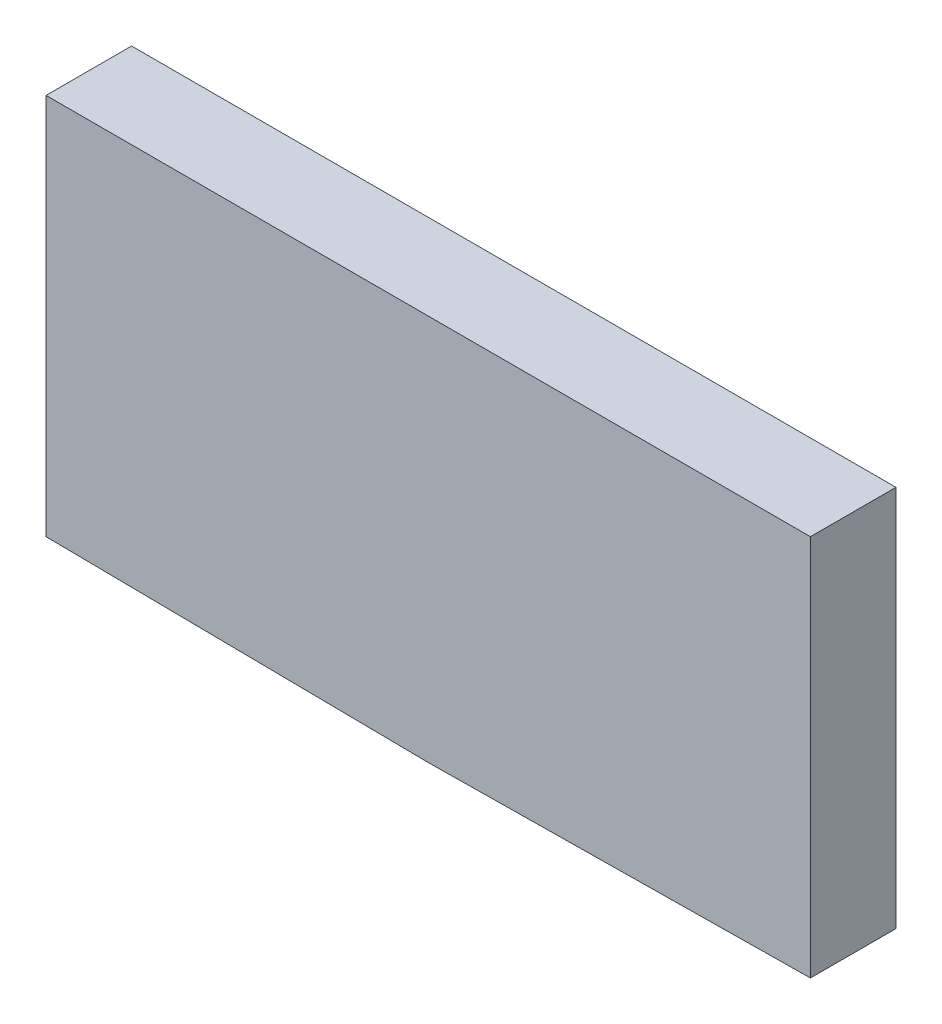
ISO-10303-21;
HEADER;
FILE_DESCRIPTION(('STEP AP214'),'2;1');
FILE_NAME('part.step','',(''),(''),'','','');
FILE_SCHEMA(('AUTOMOTIVE_DESIGN { 1 0 10303 214 1 1 1 1 }'));
ENDSEC;
DATA;
#1=APPLICATION_CONTEXT('core data for automotive mechanical design processes');
#2=APPLICATION_PROTOCOL_DEFINITION('international standard','automotive_design',2000,#1);
#3=PRODUCT_CONTEXT('',#1,'mechanical');
#4=PRODUCT('Part','Part','',(#3));
#5=PRODUCT_RELATED_PRODUCT_CATEGORY('part','',(#4));
#6=PRODUCT_DEFINITION_FORMATION('','',#4);
#7=PRODUCT_DEFINITION_CONTEXT('part definition',#1,'design');
#8=PRODUCT_DEFINITION('design','',#6,#7);
#9=PRODUCT_DEFINITION_SHAPE('','',#8);
#10=(LENGTH_UNIT() NAMED_UNIT(*) SI_UNIT(.MILLI.,.METRE.));
#11=(NAMED_UNIT(*) PLANE_ANGLE_UNIT() SI_UNIT($,.RADIAN.));
#12=(NAMED_UNIT(*) SI_UNIT($,.STERADIAN.) SOLID_ANGLE_UNIT());
#13=UNCERTAINTY_MEASURE_WITH_UNIT(LENGTH_MEASURE(1.E-05),#10,'distance_accuracy_value','');
#14=(GEOMETRIC_REPRESENTATION_CONTEXT(3) GLOBAL_UNCERTAINTY_ASSIGNED_CONTEXT((#13)) GLOBAL_UNIT_ASSIGNED_CONTEXT((#10,
#11,#12)) REPRESENTATION_CONTEXT('',''));
#15=CARTESIAN_POINT('',(0.,0.,0.));
#16=DIRECTION('',(0.,0.,1.));
#17=DIRECTION('',(1.,0.,0.));
#18=AXIS2_PLACEMENT_3D('',#15,#16,#17);
#19=CARTESIAN_POINT('',(14.3,0.168160442431913,3.2));
#20=DIRECTION('',(-0.0117586585027959,0.999930864585254,0.));
#21=DIRECTION('',(-0.999930864585255,-0.0117586585027959,0.));
#22=AXIS2_PLACEMENT_3D('',#19,#20,#21);
#23=PLANE('',#22);
#24=DIRECTION('',(0.999930864585254,0.0117586585027959,0.));
#25=VECTOR('',#24,1.);
#26=CARTESIAN_POINT('',(14.3,0.168160442431913,0.));
#27=LINE('',#26,#25);
#28=CARTESIAN_POINT('',(0.,0.,0.));
#29=VERTEX_POINT('',#28);
#30=CARTESIAN_POINT('',(14.3,0.168160442431913,0.));
#31=VERTEX_POINT('',#30);
#32=EDGE_CURVE('E111',#29,#31,#27,.T.);
#33=ORIENTED_EDGE('',*,*,#32,.T.);
#34=DIRECTION('',(0.,0.,-1.));
#35=VECTOR('',#34,1.);
#36=CARTESIAN_POINT('',(14.3,0.168160442431913,3.2));
#37=LINE('',#36,#35);
#38=CARTESIAN_POINT('',(14.3,0.168160442431913,3.2));
#39=VERTEX_POINT('',#38);
#40=EDGE_CURVE('E11',#39,#31,#37,.T.);
#41=ORIENTED_EDGE('',*,*,#40,.F.);
#42=DIRECTION('',(0.999930864585254,0.0117586585027959,0.));
#43=VECTOR('',#42,1.);
#44=CARTESIAN_POINT('',(14.3,0.168160442431913,3.2));
#45=LINE('',#44,#43);
#46=CARTESIAN_POINT('',(0.,0.,3.2));
#47=VERTEX_POINT('',#46);
#48=EDGE_CURVE('E119',#47,#39,#45,.T.);
#49=ORIENTED_EDGE('',*,*,#48,.F.);
#50=DIRECTION('',(0.,0.,-1.));
#51=VECTOR('',#50,1.);
#52=CARTESIAN_POINT('',(0.,0.,3.2));
#53=LINE('',#52,#51);
#54=EDGE_CURVE('E107',#47,#29,#53,.T.);
#55=ORIENTED_EDGE('',*,*,#54,.T.);
#56=EDGE_LOOP('',(#33,#41,#49,#55));
#57=FACE_BOUND('',#56,.T.);
#58=ADVANCED_FACE('F37',(#57),#23,.F.);
#59=CARTESIAN_POINT('',(14.3,14.4681604424319,3.2));
#60=DIRECTION('',(-1.,0.,0.));
#61=DIRECTION('',(0.,-1.,0.));
#62=AXIS2_PLACEMENT_3D('',#59,#60,#61);
#63=PLANE('',#62);
#64=DIRECTION('',(0.,1.,0.));
#65=VECTOR('',#64,1.);
#66=CARTESIAN_POINT('',(14.3,14.4681604424319,0.));
#67=LINE('',#66,#65);
#68=CARTESIAN_POINT('',(14.3,14.4681604424319,0.));
#69=VERTEX_POINT('',#68);
#70=EDGE_CURVE('E114',#31,#69,#67,.T.);
#71=ORIENTED_EDGE('',*,*,#70,.T.);
#72=DIRECTION('',(0.,0.,-1.));
#73=VECTOR('',#72,1.);
#74=CARTESIAN_POINT('',(14.3,14.4681604424319,3.2));
#75=LINE('',#74,#73);
#76=CARTESIAN_POINT('',(14.3,14.4681604424319,3.2));
#77=VERTEX_POINT('',#76);
#78=EDGE_CURVE('E45',#77,#69,#75,.T.);
#79=ORIENTED_EDGE('',*,*,#78,.F.);
#80=DIRECTION('',(0.,1.,0.));
#81=VECTOR('',#80,1.);
#82=CARTESIAN_POINT('',(14.3,14.4681604424319,3.2));
#83=LINE('',#82,#81);
#84=EDGE_CURVE('E87',#39,#77,#83,.T.);
#85=ORIENTED_EDGE('',*,*,#84,.F.);
#86=ORIENTED_EDGE('',*,*,#40,.T.);
#87=EDGE_LOOP('',(#71,#79,#85,#86));
#88=FACE_BOUND('',#87,.T.);
#89=ADVANCED_FACE('F138',(#88),#63,.F.);
#90=CARTESIAN_POINT('',(14.3,14.4681604424319,3.2));
#91=DIRECTION('',(0.,-1.,0.));
#92=DIRECTION('',(1.,0.,0.));
#93=AXIS2_PLACEMENT_3D('',#90,#91,#92);
#94=PLANE('',#93);
#95=DIRECTION('',(-1.,0.,0.));
#96=VECTOR('',#95,1.);
#97=CARTESIAN_POINT('',(14.3,14.4681604424319,0.));
#98=LINE('',#97,#96);
#99=CARTESIAN_POINT('',(-14.3,14.4681604424319,0.));
#100=VERTEX_POINT('',#99);
#101=EDGE_CURVE('E102',#69,#100,#98,.T.);
#102=ORIENTED_EDGE('',*,*,#101,.T.);
#103=DIRECTION('',(0.,0.,-1.));
#104=VECTOR('',#103,1.);
#105=CARTESIAN_POINT('',(-14.3,14.4681604424319,3.2));
#106=LINE('',#105,#104);
#107=CARTESIAN_POINT('',(-14.3,14.4681604424319,3.2));
#108=VERTEX_POINT('',#107);
#109=EDGE_CURVE('E99',#108,#100,#106,.T.);
#110=ORIENTED_EDGE('',*,*,#109,.F.);
#111=DIRECTION('',(-1.,0.,0.));
#112=VECTOR('',#111,1.);
#113=CARTESIAN_POINT('',(14.3,14.4681604424319,3.2));
#114=LINE('',#113,#112);
#115=EDGE_CURVE('E91',#77,#108,#114,.T.);
#116=ORIENTED_EDGE('',*,*,#115,.F.);
#117=ORIENTED_EDGE('',*,*,#78,.T.);
#118=EDGE_LOOP('',(#102,#110,#116,#117));
#119=FACE_BOUND('',#118,.T.);
#120=ADVANCED_FACE('F100',(#119),#94,.F.);
#121=CARTESIAN_POINT('',(-14.3,14.4681604424319,3.2));
#122=DIRECTION('',(1.,0.,0.));
#123=DIRECTION('',(0.,1.,0.));
#124=AXIS2_PLACEMENT_3D('',#121,#122,#123);
#125=PLANE('',#124);
#126=DIRECTION('',(0.,-1.,0.));
#127=VECTOR('',#126,1.);
#128=CARTESIAN_POINT('',(-14.3,14.4681604424319,0.));
#129=LINE('',#128,#127);
#130=CARTESIAN_POINT('',(-14.3,0.168160442431913,0.));
#131=VERTEX_POINT('',#130);
#132=EDGE_CURVE('E73',#100,#131,#129,.T.);
#133=ORIENTED_EDGE('',*,*,#132,.T.);
#134=DIRECTION('',(0.,0.,-1.));
#135=VECTOR('',#134,1.);
#136=CARTESIAN_POINT('',(-14.3,0.168160442431913,3.2));
#137=LINE('',#136,#135);
#138=CARTESIAN_POINT('',(-14.3,0.168160442431913,3.2));
#139=VERTEX_POINT('',#138);
#140=EDGE_CURVE('E103',#139,#131,#137,.T.);
#141=ORIENTED_EDGE('',*,*,#140,.F.);
#142=DIRECTION('',(0.,-1.,0.));
#143=VECTOR('',#142,1.);
#144=CARTESIAN_POINT('',(-14.3,14.4681604424319,3.2));
#145=LINE('',#144,#143);
#146=EDGE_CURVE('E95',#108,#139,#145,.T.);
#147=ORIENTED_EDGE('',*,*,#146,.F.);
#148=ORIENTED_EDGE('',*,*,#109,.T.);
#149=EDGE_LOOP('',(#133,#141,#147,#148));
#150=FACE_BOUND('',#149,.T.);
#151=ADVANCED_FACE('F105',(#150),#125,.F.);
#152=CARTESIAN_POINT('',(-14.3,0.168160442431913,3.2));
#153=DIRECTION('',(0.0117586585027959,0.999930864585254,0.));
#154=DIRECTION('',(-0.999930864585255,0.0117586585027959,0.));
#155=AXIS2_PLACEMENT_3D('',#152,#153,#154);
#156=PLANE('',#155);
#157=DIRECTION('',(0.999930864585254,-0.0117586585027959,0.));
#158=VECTOR('',#157,1.);
#159=CARTESIAN_POINT('',(-14.3,0.168160442431913,0.));
#160=LINE('',#159,#158);
#161=EDGE_CURVE('E79',#131,#29,#160,.T.);
#162=ORIENTED_EDGE('',*,*,#161,.T.);
#163=ORIENTED_EDGE('',*,*,#54,.F.);
#164=DIRECTION('',(0.999930864585254,-0.0117586585027959,0.));
#165=VECTOR('',#164,1.);
#166=CARTESIAN_POINT('',(-14.3,0.168160442431913,3.2));
#167=LINE('',#166,#165);
#168=EDGE_CURVE('E53',#139,#47,#167,.T.);
#169=ORIENTED_EDGE('',*,*,#168,.F.);
#170=ORIENTED_EDGE('',*,*,#140,.T.);
#171=EDGE_LOOP('',(#162,#163,#169,#170));
#172=FACE_BOUND('',#171,.T.);
#173=ADVANCED_FACE('F127',(#172),#156,.F.);
#174=CARTESIAN_POINT('',(0.,0.,3.2));
#175=DIRECTION('',(0.,0.,1.));
#176=DIRECTION('',(1.,0.,0.));
#177=AXIS2_PLACEMENT_3D('',#174,#175,#176);
#178=PLANE('',#177);
#179=ORIENTED_EDGE('',*,*,#48,.T.);
#180=ORIENTED_EDGE('',*,*,#84,.T.);
#181=ORIENTED_EDGE('',*,*,#115,.T.);
#182=ORIENTED_EDGE('',*,*,#146,.T.);
#183=ORIENTED_EDGE('',*,*,#168,.T.);
#184=EDGE_LOOP('',(#179,#180,#181,#182,#183));
#185=FACE_BOUND('',#184,.T.);
#186=ADVANCED_FACE('F93',(#185),#178,.T.);
#187=CARTESIAN_POINT('',(0.,0.,0.));
#188=DIRECTION('',(0.,0.,1.));
#189=DIRECTION('',(1.,0.,0.));
#190=AXIS2_PLACEMENT_3D('',#187,#188,#189);
#191=PLANE('',#190);
#192=ORIENTED_EDGE('',*,*,#32,.F.);
#193=ORIENTED_EDGE('',*,*,#161,.F.);
#194=ORIENTED_EDGE('',*,*,#132,.F.);
#195=ORIENTED_EDGE('',*,*,#101,.F.);
#196=ORIENTED_EDGE('',*,*,#70,.F.);
#197=EDGE_LOOP('',(#192,#193,#194,#195,#196));
#198=FACE_BOUND('',#197,.T.);
#199=ADVANCED_FACE('F123',(#198),#191,.F.);
#200=CLOSED_SHELL('',(#58,#89,#120,#151,#173,#186,#199));
#201=MANIFOLD_SOLID_BREP('B2',#200);
#202=ADVANCED_BREP_SHAPE_REPRESENTATION('',(#18,#201),#14);
#203=SHAPE_DEFINITION_REPRESENTATION(#9,#202);
ENDSEC;
END-ISO-10303-21;
